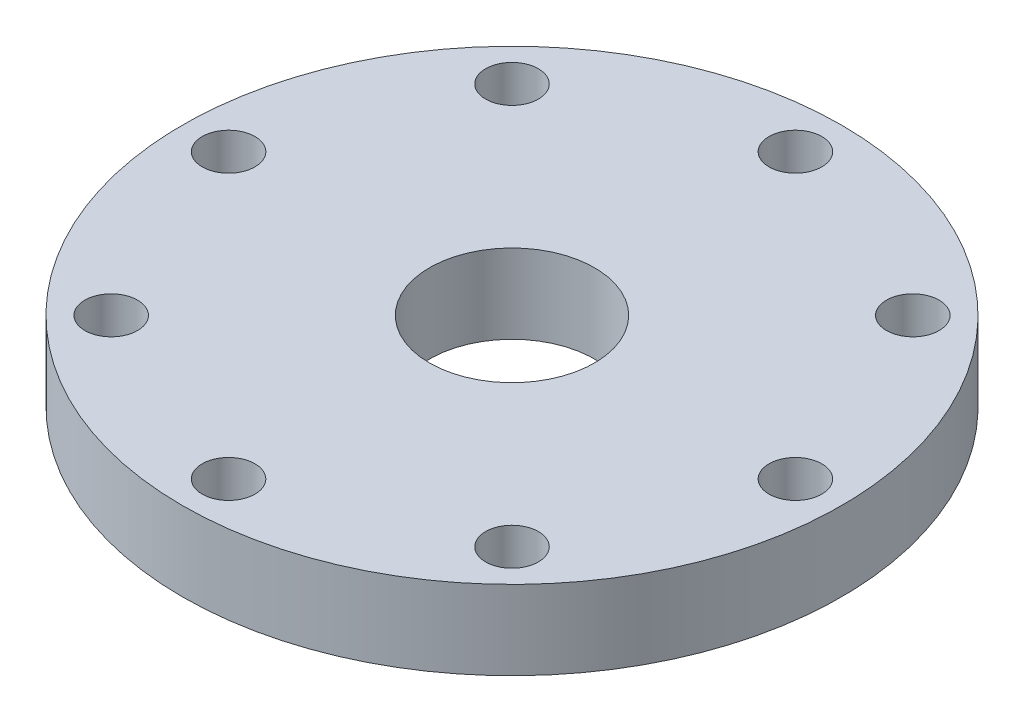
ISO-10303-21;
HEADER;
FILE_DESCRIPTION(('STEP AP214'),'2;1');
FILE_NAME('part.step','',(''),(''),'','','');
FILE_SCHEMA(('AUTOMOTIVE_DESIGN { 1 0 10303 214 1 1 1 1 }'));
ENDSEC;
DATA;
#1=APPLICATION_CONTEXT('core data for automotive mechanical design processes');
#2=APPLICATION_PROTOCOL_DEFINITION('international standard','automotive_design',2000,#1);
#3=PRODUCT_CONTEXT('',#1,'mechanical');
#4=PRODUCT('Part','Part','',(#3));
#5=PRODUCT_RELATED_PRODUCT_CATEGORY('part','',(#4));
#6=PRODUCT_DEFINITION_FORMATION('','',#4);
#7=PRODUCT_DEFINITION_CONTEXT('part definition',#1,'design');
#8=PRODUCT_DEFINITION('design','',#6,#7);
#9=PRODUCT_DEFINITION_SHAPE('','',#8);
#10=(LENGTH_UNIT() NAMED_UNIT(*) SI_UNIT(.MILLI.,.METRE.));
#11=(NAMED_UNIT(*) PLANE_ANGLE_UNIT() SI_UNIT($,.RADIAN.));
#12=(NAMED_UNIT(*) SI_UNIT($,.STERADIAN.) SOLID_ANGLE_UNIT());
#13=UNCERTAINTY_MEASURE_WITH_UNIT(LENGTH_MEASURE(1.E-05),#10,'distance_accuracy_value','');
#14=(GEOMETRIC_REPRESENTATION_CONTEXT(3) GLOBAL_UNCERTAINTY_ASSIGNED_CONTEXT((#13)) GLOBAL_UNIT_ASSIGNED_CONTEXT((#10,
#11,#12)) REPRESENTATION_CONTEXT('',''));
#15=CARTESIAN_POINT('',(0.,0.,0.));
#16=DIRECTION('',(0.,0.,1.));
#17=DIRECTION('',(1.,0.,0.));
#18=AXIS2_PLACEMENT_3D('',#15,#16,#17);
#19=CARTESIAN_POINT('',(0.,6.,0.));
#20=DIRECTION('',(0.,1.,0.));
#21=DIRECTION('',(0.,0.,1.));
#22=AXIS2_PLACEMENT_3D('',#19,#20,#21);
#23=PLANE('',#22);
#24=CARTESIAN_POINT('',(-21.5,6.,0.));
#25=DIRECTION('',(0.,1.,0.));
#26=DIRECTION('',(0.,0.,1.));
#27=AXIS2_PLACEMENT_3D('',#24,#25,#26);
#28=CIRCLE('',#27,2.);
#29=CARTESIAN_POINT('',(-21.5,6.,2.00000000000001));
#30=VERTEX_POINT('',#29);
#31=EDGE_CURVE('E160',#30,#30,#28,.T.);
#32=ORIENTED_EDGE('',*,*,#31,.F.);
#33=EDGE_LOOP('',(#32));
#34=FACE_BOUND('',#33,.T.);
#35=CARTESIAN_POINT('',(0.,6.,21.5));
#36=DIRECTION('',(0.,1.,0.));
#37=DIRECTION('',(0.,0.,1.));
#38=AXIS2_PLACEMENT_3D('',#35,#36,#37);
#39=CIRCLE('',#38,2.);
#40=CARTESIAN_POINT('',(0.,6.,23.5));
#41=VERTEX_POINT('',#40);
#42=EDGE_CURVE('E144',#41,#41,#39,.T.);
#43=ORIENTED_EDGE('',*,*,#42,.F.);
#44=EDGE_LOOP('',(#43));
#45=FACE_BOUND('',#44,.T.);
#46=CARTESIAN_POINT('',(15.2027957955108,6.,15.2027957955108));
#47=DIRECTION('',(0.,1.,0.));
#48=DIRECTION('',(0.,0.,1.));
#49=AXIS2_PLACEMENT_3D('',#46,#47,#48);
#50=CIRCLE('',#49,2.);
#51=CARTESIAN_POINT('',(15.2027957955108,6.,17.2027957955108));
#52=VERTEX_POINT('',#51);
#53=EDGE_CURVE('E128',#52,#52,#50,.T.);
#54=ORIENTED_EDGE('',*,*,#53,.F.);
#55=EDGE_LOOP('',(#54));
#56=FACE_BOUND('',#55,.T.);
#57=CARTESIAN_POINT('',(15.2027957955108,6.,-15.2027957955108));
#58=DIRECTION('',(0.,1.,0.));
#59=DIRECTION('',(0.,0.,1.));
#60=AXIS2_PLACEMENT_3D('',#57,#58,#59);
#61=CIRCLE('',#60,2.);
#62=CARTESIAN_POINT('',(15.2027957955108,6.,-13.2027957955108));
#63=VERTEX_POINT('',#62);
#64=EDGE_CURVE('E112',#63,#63,#61,.T.);
#65=ORIENTED_EDGE('',*,*,#64,.F.);
#66=EDGE_LOOP('',(#65));
#67=FACE_BOUND('',#66,.T.);
#68=CARTESIAN_POINT('',(0.,6.,0.));
#69=DIRECTION('',(0.,1.,0.));
#70=DIRECTION('',(0.,0.,1.));
#71=AXIS2_PLACEMENT_3D('',#68,#69,#70);
#72=CIRCLE('',#71,25.);
#73=CARTESIAN_POINT('',(0.,6.,25.));
#74=VERTEX_POINT('',#73);
#75=EDGE_CURVE('E11',#74,#74,#72,.T.);
#76=ORIENTED_EDGE('',*,*,#75,.T.);
#77=EDGE_LOOP('',(#76));
#78=FACE_BOUND('',#77,.T.);
#79=CARTESIAN_POINT('',(0.,6.,-21.5));
#80=DIRECTION('',(0.,1.,0.));
#81=DIRECTION('',(0.,0.,1.));
#82=AXIS2_PLACEMENT_3D('',#79,#80,#81);
#83=CIRCLE('',#82,2.);
#84=CARTESIAN_POINT('',(0.,6.,-19.5));
#85=VERTEX_POINT('',#84);
#86=EDGE_CURVE('E106',#85,#85,#83,.T.);
#87=ORIENTED_EDGE('',*,*,#86,.F.);
#88=EDGE_LOOP('',(#87));
#89=FACE_BOUND('',#88,.T.);
#90=CARTESIAN_POINT('',(21.5,6.,0.));
#91=DIRECTION('',(0.,1.,0.));
#92=DIRECTION('',(0.,0.,1.));
#93=AXIS2_PLACEMENT_3D('',#90,#91,#92);
#94=CIRCLE('',#93,2.);
#95=CARTESIAN_POINT('',(21.5,6.,2.));
#96=VERTEX_POINT('',#95);
#97=EDGE_CURVE('E120',#96,#96,#94,.T.);
#98=ORIENTED_EDGE('',*,*,#97,.F.);
#99=EDGE_LOOP('',(#98));
#100=FACE_BOUND('',#99,.T.);
#101=CARTESIAN_POINT('',(0.,6.,0.));
#102=DIRECTION('',(0.,1.,0.));
#103=DIRECTION('',(0.,0.,1.));
#104=AXIS2_PLACEMENT_3D('',#101,#102,#103);
#105=CIRCLE('',#104,6.26066856554278);
#106=CARTESIAN_POINT('',(0.,6.,6.26066856554278));
#107=VERTEX_POINT('',#106);
#108=EDGE_CURVE('E136',#107,#107,#105,.T.);
#109=ORIENTED_EDGE('',*,*,#108,.F.);
#110=EDGE_LOOP('',(#109));
#111=FACE_BOUND('',#110,.T.);
#112=CARTESIAN_POINT('',(-15.2027957955108,6.,15.2027957955108));
#113=DIRECTION('',(0.,1.,0.));
#114=DIRECTION('',(0.,0.,1.));
#115=AXIS2_PLACEMENT_3D('',#112,#113,#114);
#116=CIRCLE('',#115,2.);
#117=CARTESIAN_POINT('',(-15.2027957955108,6.,17.2027957955108));
#118=VERTEX_POINT('',#117);
#119=EDGE_CURVE('E152',#118,#118,#116,.T.);
#120=ORIENTED_EDGE('',*,*,#119,.F.);
#121=EDGE_LOOP('',(#120));
#122=FACE_BOUND('',#121,.T.);
#123=CARTESIAN_POINT('',(-15.2027957955108,6.,-15.2027957955108));
#124=DIRECTION('',(0.,1.,0.));
#125=DIRECTION('',(0.,0.,1.));
#126=AXIS2_PLACEMENT_3D('',#123,#124,#125);
#127=CIRCLE('',#126,2.);
#128=CARTESIAN_POINT('',(-15.2027957955108,6.,-13.2027957955108));
#129=VERTEX_POINT('',#128);
#130=EDGE_CURVE('E168',#129,#129,#127,.T.);
#131=ORIENTED_EDGE('',*,*,#130,.F.);
#132=EDGE_LOOP('',(#131));
#133=FACE_BOUND('',#132,.T.);
#134=ADVANCED_FACE('F93',(#34,#45,#56,#67,#78,#89,#100,#111,#122,#133),#23,.T.);
#135=CARTESIAN_POINT('',(0.,0.,0.));
#136=DIRECTION('',(0.,1.,0.));
#137=DIRECTION('',(0.,0.,1.));
#138=AXIS2_PLACEMENT_3D('',#135,#136,#137);
#139=PLANE('',#138);
#140=CARTESIAN_POINT('',(0.,0.,0.));
#141=DIRECTION('',(0.,1.,0.));
#142=DIRECTION('',(0.,0.,1.));
#143=AXIS2_PLACEMENT_3D('',#140,#141,#142);
#144=CIRCLE('',#143,25.);
#145=CARTESIAN_POINT('',(0.,0.,25.));
#146=VERTEX_POINT('',#145);
#147=EDGE_CURVE('E97',#146,#146,#144,.T.);
#148=ORIENTED_EDGE('',*,*,#147,.F.);
#149=EDGE_LOOP('',(#148));
#150=FACE_BOUND('',#149,.T.);
#151=CARTESIAN_POINT('',(0.,0.,-21.5));
#152=DIRECTION('',(0.,1.,0.));
#153=DIRECTION('',(0.,0.,1.));
#154=AXIS2_PLACEMENT_3D('',#151,#152,#153);
#155=CIRCLE('',#154,2.);
#156=CARTESIAN_POINT('',(0.,0.,-19.5));
#157=VERTEX_POINT('',#156);
#158=EDGE_CURVE('E108',#157,#157,#155,.T.);
#159=ORIENTED_EDGE('',*,*,#158,.T.);
#160=EDGE_LOOP('',(#159));
#161=FACE_BOUND('',#160,.T.);
#162=CARTESIAN_POINT('',(15.2027957955108,0.,-15.2027957955108));
#163=DIRECTION('',(0.,1.,0.));
#164=DIRECTION('',(0.,0.,1.));
#165=AXIS2_PLACEMENT_3D('',#162,#163,#164);
#166=CIRCLE('',#165,2.);
#167=CARTESIAN_POINT('',(15.2027957955108,0.,-13.2027957955108));
#168=VERTEX_POINT('',#167);
#169=EDGE_CURVE('E116',#168,#168,#166,.T.);
#170=ORIENTED_EDGE('',*,*,#169,.T.);
#171=EDGE_LOOP('',(#170));
#172=FACE_BOUND('',#171,.T.);
#173=CARTESIAN_POINT('',(21.5,0.,0.));
#174=DIRECTION('',(0.,1.,0.));
#175=DIRECTION('',(0.,0.,1.));
#176=AXIS2_PLACEMENT_3D('',#173,#174,#175);
#177=CIRCLE('',#176,2.);
#178=CARTESIAN_POINT('',(21.5,0.,2.));
#179=VERTEX_POINT('',#178);
#180=EDGE_CURVE('E124',#179,#179,#177,.T.);
#181=ORIENTED_EDGE('',*,*,#180,.T.);
#182=EDGE_LOOP('',(#181));
#183=FACE_BOUND('',#182,.T.);
#184=CARTESIAN_POINT('',(15.2027957955108,0.,15.2027957955108));
#185=DIRECTION('',(0.,1.,0.));
#186=DIRECTION('',(0.,0.,1.));
#187=AXIS2_PLACEMENT_3D('',#184,#185,#186);
#188=CIRCLE('',#187,2.);
#189=CARTESIAN_POINT('',(15.2027957955108,0.,17.2027957955108));
#190=VERTEX_POINT('',#189);
#191=EDGE_CURVE('E132',#190,#190,#188,.T.);
#192=ORIENTED_EDGE('',*,*,#191,.T.);
#193=EDGE_LOOP('',(#192));
#194=FACE_BOUND('',#193,.T.);
#195=CARTESIAN_POINT('',(0.,0.,0.));
#196=DIRECTION('',(0.,1.,0.));
#197=DIRECTION('',(0.,0.,1.));
#198=AXIS2_PLACEMENT_3D('',#195,#196,#197);
#199=CIRCLE('',#198,6.26066856554278);
#200=CARTESIAN_POINT('',(0.,0.,6.26066856554278));
#201=VERTEX_POINT('',#200);
#202=EDGE_CURVE('E140',#201,#201,#199,.T.);
#203=ORIENTED_EDGE('',*,*,#202,.T.);
#204=EDGE_LOOP('',(#203));
#205=FACE_BOUND('',#204,.T.);
#206=CARTESIAN_POINT('',(0.,0.,21.5));
#207=DIRECTION('',(0.,1.,0.));
#208=DIRECTION('',(0.,0.,1.));
#209=AXIS2_PLACEMENT_3D('',#206,#207,#208);
#210=CIRCLE('',#209,2.);
#211=CARTESIAN_POINT('',(0.,0.,23.5));
#212=VERTEX_POINT('',#211);
#213=EDGE_CURVE('E148',#212,#212,#210,.T.);
#214=ORIENTED_EDGE('',*,*,#213,.T.);
#215=EDGE_LOOP('',(#214));
#216=FACE_BOUND('',#215,.T.);
#217=CARTESIAN_POINT('',(-15.2027957955108,0.,15.2027957955108));
#218=DIRECTION('',(0.,1.,0.));
#219=DIRECTION('',(0.,0.,1.));
#220=AXIS2_PLACEMENT_3D('',#217,#218,#219);
#221=CIRCLE('',#220,2.);
#222=CARTESIAN_POINT('',(-15.2027957955108,0.,17.2027957955108));
#223=VERTEX_POINT('',#222);
#224=EDGE_CURVE('E156',#223,#223,#221,.T.);
#225=ORIENTED_EDGE('',*,*,#224,.T.);
#226=EDGE_LOOP('',(#225));
#227=FACE_BOUND('',#226,.T.);
#228=CARTESIAN_POINT('',(-21.5,0.,0.));
#229=DIRECTION('',(0.,1.,0.));
#230=DIRECTION('',(0.,0.,1.));
#231=AXIS2_PLACEMENT_3D('',#228,#229,#230);
#232=CIRCLE('',#231,2.);
#233=CARTESIAN_POINT('',(-21.5,0.,2.00000000000001));
#234=VERTEX_POINT('',#233);
#235=EDGE_CURVE('E164',#234,#234,#232,.T.);
#236=ORIENTED_EDGE('',*,*,#235,.T.);
#237=EDGE_LOOP('',(#236));
#238=FACE_BOUND('',#237,.T.);
#239=CARTESIAN_POINT('',(-15.2027957955108,0.,-15.2027957955108));
#240=DIRECTION('',(0.,1.,0.));
#241=DIRECTION('',(0.,0.,1.));
#242=AXIS2_PLACEMENT_3D('',#239,#240,#241);
#243=CIRCLE('',#242,2.);
#244=CARTESIAN_POINT('',(-15.2027957955108,0.,-13.2027957955108));
#245=VERTEX_POINT('',#244);
#246=EDGE_CURVE('E172',#245,#245,#243,.T.);
#247=ORIENTED_EDGE('',*,*,#246,.T.);
#248=EDGE_LOOP('',(#247));
#249=FACE_BOUND('',#248,.T.);
#250=ADVANCED_FACE('F184',(#150,#161,#172,#183,#194,#205,#216,#227,#238,#249),#139,.F.);
#251=CARTESIAN_POINT('',(0.,6.,0.));
#252=DIRECTION('',(0.,-1.,0.));
#253=DIRECTION('',(0.,0.,-1.));
#254=AXIS2_PLACEMENT_3D('',#251,#252,#253);
#255=CYLINDRICAL_SURFACE('',#254,25.);
#256=ORIENTED_EDGE('',*,*,#75,.F.);
#257=EDGE_LOOP('',(#256));
#258=FACE_BOUND('',#257,.T.);
#259=ORIENTED_EDGE('',*,*,#147,.T.);
#260=EDGE_LOOP('',(#259));
#261=FACE_BOUND('',#260,.T.);
#262=ADVANCED_FACE('F95',(#258,#261),#255,.T.);
#263=CARTESIAN_POINT('',(0.,6.,-21.5));
#264=DIRECTION('',(0.,-1.,0.));
#265=DIRECTION('',(0.,0.,-1.));
#266=AXIS2_PLACEMENT_3D('',#263,#264,#265);
#267=CYLINDRICAL_SURFACE('',#266,2.);
#268=ORIENTED_EDGE('',*,*,#86,.T.);
#269=EDGE_LOOP('',(#268));
#270=FACE_BOUND('',#269,.T.);
#271=ORIENTED_EDGE('',*,*,#158,.F.);
#272=EDGE_LOOP('',(#271));
#273=FACE_BOUND('',#272,.T.);
#274=ADVANCED_FACE('F194',(#270,#273),#267,.F.);
#275=CARTESIAN_POINT('',(15.2027957955108,6.,-15.2027957955108));
#276=DIRECTION('',(0.,-1.,0.));
#277=DIRECTION('',(0.,0.,-1.));
#278=AXIS2_PLACEMENT_3D('',#275,#276,#277);
#279=CYLINDRICAL_SURFACE('',#278,2.);
#280=ORIENTED_EDGE('',*,*,#64,.T.);
#281=EDGE_LOOP('',(#280));
#282=FACE_BOUND('',#281,.T.);
#283=ORIENTED_EDGE('',*,*,#169,.F.);
#284=EDGE_LOOP('',(#283));
#285=FACE_BOUND('',#284,.T.);
#286=ADVANCED_FACE('F197',(#282,#285),#279,.F.);
#287=CARTESIAN_POINT('',(21.5,6.,0.));
#288=DIRECTION('',(0.,-1.,0.));
#289=DIRECTION('',(0.,0.,-1.));
#290=AXIS2_PLACEMENT_3D('',#287,#288,#289);
#291=CYLINDRICAL_SURFACE('',#290,2.);
#292=ORIENTED_EDGE('',*,*,#97,.T.);
#293=EDGE_LOOP('',(#292));
#294=FACE_BOUND('',#293,.T.);
#295=ORIENTED_EDGE('',*,*,#180,.F.);
#296=EDGE_LOOP('',(#295));
#297=FACE_BOUND('',#296,.T.);
#298=ADVANCED_FACE('F201',(#294,#297),#291,.F.);
#299=CARTESIAN_POINT('',(15.2027957955108,6.,15.2027957955108));
#300=DIRECTION('',(0.,-1.,0.));
#301=DIRECTION('',(0.,0.,-1.));
#302=AXIS2_PLACEMENT_3D('',#299,#300,#301);
#303=CYLINDRICAL_SURFACE('',#302,2.);
#304=ORIENTED_EDGE('',*,*,#53,.T.);
#305=EDGE_LOOP('',(#304));
#306=FACE_BOUND('',#305,.T.);
#307=ORIENTED_EDGE('',*,*,#191,.F.);
#308=EDGE_LOOP('',(#307));
#309=FACE_BOUND('',#308,.T.);
#310=ADVANCED_FACE('F205',(#306,#309),#303,.F.);
#311=CARTESIAN_POINT('',(0.,6.,0.));
#312=DIRECTION('',(0.,-1.,0.));
#313=DIRECTION('',(0.,0.,-1.));
#314=AXIS2_PLACEMENT_3D('',#311,#312,#313);
#315=CYLINDRICAL_SURFACE('',#314,6.26066856554278);
#316=ORIENTED_EDGE('',*,*,#108,.T.);
#317=EDGE_LOOP('',(#316));
#318=FACE_BOUND('',#317,.T.);
#319=ORIENTED_EDGE('',*,*,#202,.F.);
#320=EDGE_LOOP('',(#319));
#321=FACE_BOUND('',#320,.T.);
#322=ADVANCED_FACE('F209',(#318,#321),#315,.F.);
#323=CARTESIAN_POINT('',(0.,6.,21.5));
#324=DIRECTION('',(0.,-1.,0.));
#325=DIRECTION('',(0.,0.,-1.));
#326=AXIS2_PLACEMENT_3D('',#323,#324,#325);
#327=CYLINDRICAL_SURFACE('',#326,2.);
#328=ORIENTED_EDGE('',*,*,#42,.T.);
#329=EDGE_LOOP('',(#328));
#330=FACE_BOUND('',#329,.T.);
#331=ORIENTED_EDGE('',*,*,#213,.F.);
#332=EDGE_LOOP('',(#331));
#333=FACE_BOUND('',#332,.T.);
#334=ADVANCED_FACE('F213',(#330,#333),#327,.F.);
#335=CARTESIAN_POINT('',(-15.2027957955108,6.,15.2027957955108));
#336=DIRECTION('',(0.,-1.,0.));
#337=DIRECTION('',(0.,0.,-1.));
#338=AXIS2_PLACEMENT_3D('',#335,#336,#337);
#339=CYLINDRICAL_SURFACE('',#338,2.);
#340=ORIENTED_EDGE('',*,*,#119,.T.);
#341=EDGE_LOOP('',(#340));
#342=FACE_BOUND('',#341,.T.);
#343=ORIENTED_EDGE('',*,*,#224,.F.);
#344=EDGE_LOOP('',(#343));
#345=FACE_BOUND('',#344,.T.);
#346=ADVANCED_FACE('F217',(#342,#345),#339,.F.);
#347=CARTESIAN_POINT('',(-21.5,6.,0.));
#348=DIRECTION('',(0.,-1.,0.));
#349=DIRECTION('',(0.,0.,-1.));
#350=AXIS2_PLACEMENT_3D('',#347,#348,#349);
#351=CYLINDRICAL_SURFACE('',#350,2.);
#352=ORIENTED_EDGE('',*,*,#31,.T.);
#353=EDGE_LOOP('',(#352));
#354=FACE_BOUND('',#353,.T.);
#355=ORIENTED_EDGE('',*,*,#235,.F.);
#356=EDGE_LOOP('',(#355));
#357=FACE_BOUND('',#356,.T.);
#358=ADVANCED_FACE('F221',(#354,#357),#351,.F.);
#359=CARTESIAN_POINT('',(-15.2027957955108,6.,-15.2027957955108));
#360=DIRECTION('',(0.,-1.,0.));
#361=DIRECTION('',(0.,0.,-1.));
#362=AXIS2_PLACEMENT_3D('',#359,#360,#361);
#363=CYLINDRICAL_SURFACE('',#362,2.);
#364=ORIENTED_EDGE('',*,*,#130,.T.);
#365=EDGE_LOOP('',(#364));
#366=FACE_BOUND('',#365,.T.);
#367=ORIENTED_EDGE('',*,*,#246,.F.);
#368=EDGE_LOOP('',(#367));
#369=FACE_BOUND('',#368,.T.);
#370=ADVANCED_FACE('F180',(#366,#369),#363,.F.);
#371=CLOSED_SHELL('',(#134,#250,#262,#274,#286,#298,#310,#322,#334,#346,#358,#370));
#372=MANIFOLD_SOLID_BREP('B2',#371);
#373=ADVANCED_BREP_SHAPE_REPRESENTATION('',(#18,#372),#14);
#374=SHAPE_DEFINITION_REPRESENTATION(#9,#373);
ENDSEC;
END-ISO-10303-21;
